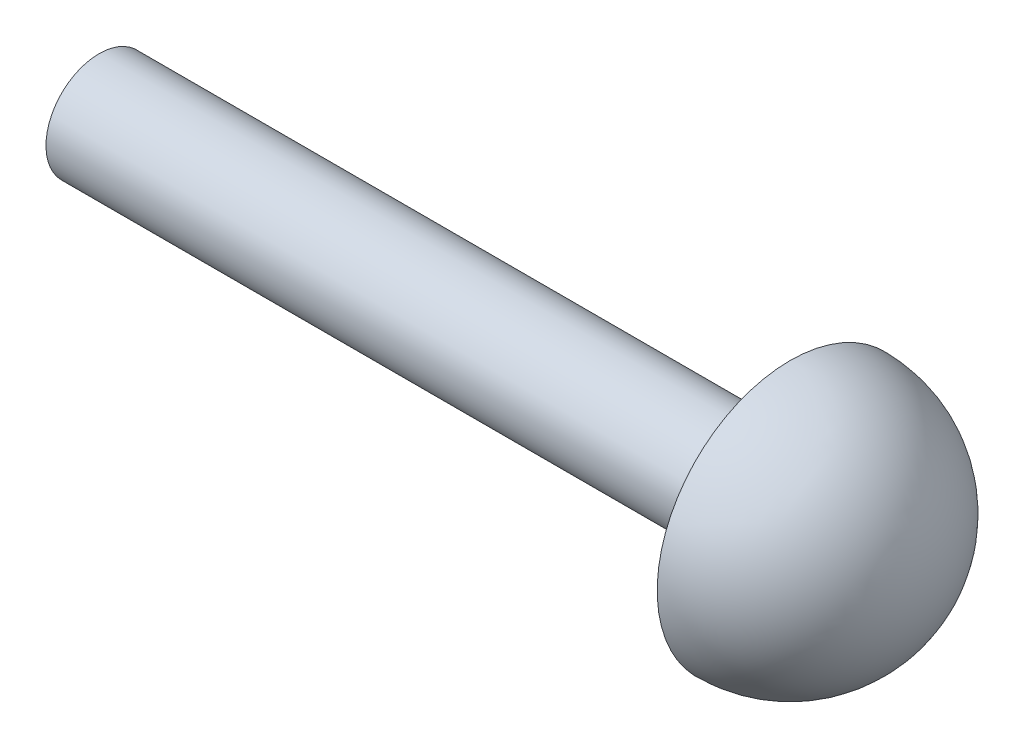
ISO-10303-21;
HEADER;
FILE_DESCRIPTION(('STEP AP214'),'2;1');
FILE_NAME('part.step','',(''),(''),'','','');
FILE_SCHEMA(('AUTOMOTIVE_DESIGN { 1 0 10303 214 1 1 1 1 }'));
ENDSEC;
DATA;
#1=APPLICATION_CONTEXT('core data for automotive mechanical design processes');
#2=APPLICATION_PROTOCOL_DEFINITION('international standard','automotive_design',2000,#1);
#3=PRODUCT_CONTEXT('',#1,'mechanical');
#4=PRODUCT('Part','Part','',(#3));
#5=PRODUCT_RELATED_PRODUCT_CATEGORY('part','',(#4));
#6=PRODUCT_DEFINITION_FORMATION('','',#4);
#7=PRODUCT_DEFINITION_CONTEXT('part definition',#1,'design');
#8=PRODUCT_DEFINITION('design','',#6,#7);
#9=PRODUCT_DEFINITION_SHAPE('','',#8);
#10=(LENGTH_UNIT() NAMED_UNIT(*) SI_UNIT(.MILLI.,.METRE.));
#11=(NAMED_UNIT(*) PLANE_ANGLE_UNIT() SI_UNIT($,.RADIAN.));
#12=(NAMED_UNIT(*) SI_UNIT($,.STERADIAN.) SOLID_ANGLE_UNIT());
#13=UNCERTAINTY_MEASURE_WITH_UNIT(LENGTH_MEASURE(1.E-05),#10,'distance_accuracy_value','');
#14=(GEOMETRIC_REPRESENTATION_CONTEXT(3) GLOBAL_UNCERTAINTY_ASSIGNED_CONTEXT((#13)) GLOBAL_UNIT_ASSIGNED_CONTEXT((#10,
#11,#12)) REPRESENTATION_CONTEXT('',''));
#15=CARTESIAN_POINT('',(0.,0.,0.));
#16=DIRECTION('',(0.,0.,1.));
#17=DIRECTION('',(1.,0.,0.));
#18=AXIS2_PLACEMENT_3D('',#15,#16,#17);
#19=CARTESIAN_POINT('',(0.,0.,0.));
#20=DIRECTION('',(1.,0.,0.));
#21=DIRECTION('',(0.,-1.,0.));
#22=AXIS2_PLACEMENT_3D('',#19,#20,#21);
#23=SPHERICAL_SURFACE('',#22,5.);
#24=CARTESIAN_POINT('',(0.,0.,0.));
#25=DIRECTION('',(1.,0.,0.));
#26=DIRECTION('',(0.,1.,0.));
#27=AXIS2_PLACEMENT_3D('',#24,#25,#26);
#28=CIRCLE('',#27,5.);
#29=CARTESIAN_POINT('',(0.,5.,0.));
#30=VERTEX_POINT('',#29);
#31=EDGE_CURVE('E10',#30,#30,#28,.T.);
#32=ORIENTED_EDGE('',*,*,#31,.T.);
#33=EDGE_LOOP('',(#32));
#34=FACE_BOUND('',#33,.T.);
#35=ADVANCED_FACE('F30',(#34),#23,.T.);
#36=CARTESIAN_POINT('',(0.,2.,0.));
#37=DIRECTION('',(-1.,0.,0.));
#38=DIRECTION('',(0.,-1.,0.));
#39=AXIS2_PLACEMENT_3D('',#36,#37,#38);
#40=PLANE('',#39);
#41=CARTESIAN_POINT('',(0.,0.,0.));
#42=DIRECTION('',(1.,0.,0.));
#43=DIRECTION('',(0.,1.,0.));
#44=AXIS2_PLACEMENT_3D('',#41,#42,#43);
#45=CIRCLE('',#44,2.);
#46=CARTESIAN_POINT('',(0.,2.,0.));
#47=VERTEX_POINT('',#46);
#48=EDGE_CURVE('E36',#47,#47,#45,.T.);
#49=ORIENTED_EDGE('',*,*,#48,.T.);
#50=EDGE_LOOP('',(#49));
#51=FACE_BOUND('',#50,.T.);
#52=ORIENTED_EDGE('',*,*,#31,.F.);
#53=EDGE_LOOP('',(#52));
#54=FACE_BOUND('',#53,.T.);
#55=ADVANCED_FACE('F56',(#51,#54),#40,.T.);
#56=CARTESIAN_POINT('',(0.,0.,0.));
#57=DIRECTION('',(1.,0.,0.));
#58=DIRECTION('',(0.,1.,0.));
#59=AXIS2_PLACEMENT_3D('',#56,#57,#58);
#60=CYLINDRICAL_SURFACE('',#59,2.);
#61=CARTESIAN_POINT('',(-26.,0.,0.));
#62=DIRECTION('',(1.,0.,0.));
#63=DIRECTION('',(0.,1.,0.));
#64=AXIS2_PLACEMENT_3D('',#61,#62,#63);
#65=CIRCLE('',#64,2.);
#66=CARTESIAN_POINT('',(-26.,2.,0.));
#67=VERTEX_POINT('',#66);
#68=EDGE_CURVE('E40',#67,#67,#65,.T.);
#69=ORIENTED_EDGE('',*,*,#68,.T.);
#70=EDGE_LOOP('',(#69));
#71=FACE_BOUND('',#70,.T.);
#72=ORIENTED_EDGE('',*,*,#48,.F.);
#73=EDGE_LOOP('',(#72));
#74=FACE_BOUND('',#73,.T.);
#75=ADVANCED_FACE('F47',(#71,#74),#60,.T.);
#76=CARTESIAN_POINT('',(-26.,0.,0.));
#77=DIRECTION('',(-1.,0.,0.));
#78=DIRECTION('',(0.,-1.,0.));
#79=AXIS2_PLACEMENT_3D('',#76,#77,#78);
#80=PLANE('',#79);
#81=ORIENTED_EDGE('',*,*,#68,.F.);
#82=EDGE_LOOP('',(#81));
#83=FACE_BOUND('',#82,.T.);
#84=ADVANCED_FACE('F50',(#83),#80,.T.);
#85=CLOSED_SHELL('',(#35,#55,#75,#84));
#86=MANIFOLD_SOLID_BREP('B2',#85);
#87=ADVANCED_BREP_SHAPE_REPRESENTATION('',(#18,#86),#14);
#88=SHAPE_DEFINITION_REPRESENTATION(#9,#87);
ENDSEC;
END-ISO-10303-21;
